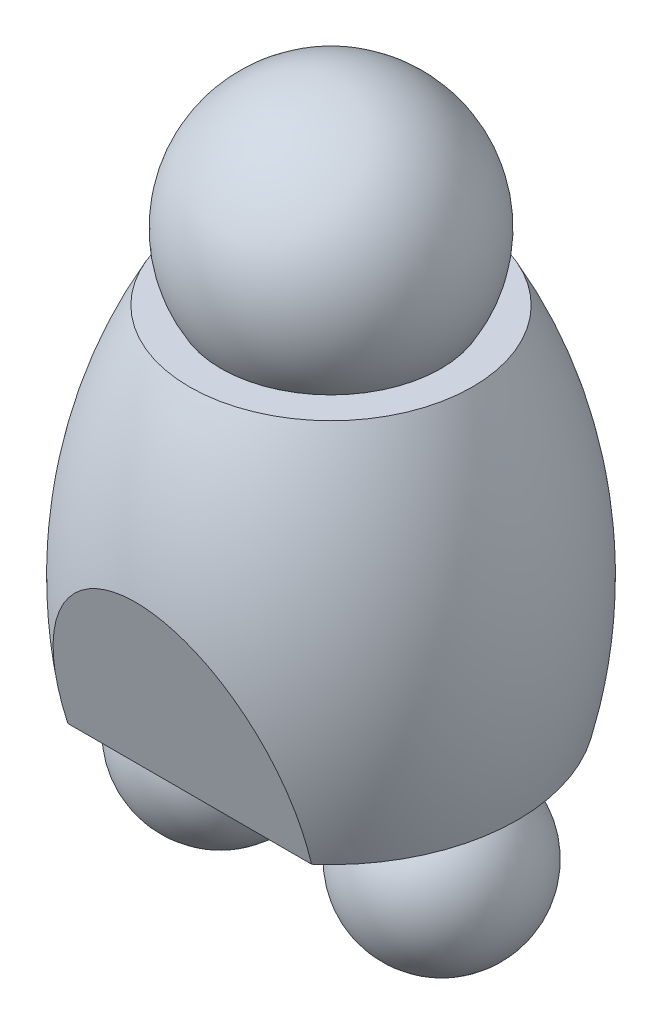
ISO-10303-21;
HEADER;
FILE_DESCRIPTION(('STEP AP214'),'2;1');
FILE_NAME('part.step','',(''),(''),'','','');
FILE_SCHEMA(('AUTOMOTIVE_DESIGN { 1 0 10303 214 1 1 1 1 }'));
ENDSEC;
DATA;
#1=APPLICATION_CONTEXT('core data for automotive mechanical design processes');
#2=APPLICATION_PROTOCOL_DEFINITION('international standard','automotive_design',2000,#1);
#3=PRODUCT_CONTEXT('',#1,'mechanical');
#4=PRODUCT('Part','Part','',(#3));
#5=PRODUCT_RELATED_PRODUCT_CATEGORY('part','',(#4));
#6=PRODUCT_DEFINITION_FORMATION('','',#4);
#7=PRODUCT_DEFINITION_CONTEXT('part definition',#1,'design');
#8=PRODUCT_DEFINITION('design','',#6,#7);
#9=PRODUCT_DEFINITION_SHAPE('','',#8);
#10=(LENGTH_UNIT() NAMED_UNIT(*) SI_UNIT(.MILLI.,.METRE.));
#11=(NAMED_UNIT(*) PLANE_ANGLE_UNIT() SI_UNIT($,.RADIAN.));
#12=(NAMED_UNIT(*) SI_UNIT($,.STERADIAN.) SOLID_ANGLE_UNIT());
#13=UNCERTAINTY_MEASURE_WITH_UNIT(LENGTH_MEASURE(1.E-05),#10,'distance_accuracy_value','');
#14=(GEOMETRIC_REPRESENTATION_CONTEXT(3) GLOBAL_UNCERTAINTY_ASSIGNED_CONTEXT((#13)) GLOBAL_UNIT_ASSIGNED_CONTEXT((#10,
#11,#12)) REPRESENTATION_CONTEXT('',''));
#15=CARTESIAN_POINT('',(0.,0.,0.));
#16=DIRECTION('',(0.,0.,1.));
#17=DIRECTION('',(1.,0.,0.));
#18=AXIS2_PLACEMENT_3D('',#15,#16,#17);
#19=CARTESIAN_POINT('',(-0.000631960450169172,92.8934839831583,0.520344473227464));
#20=DIRECTION('',(0.,-1.,0.));
#21=DIRECTION('',(0.,0.,-1.));
#22=AXIS2_PLACEMENT_3D('',#19,#20,#21);
#23=PLANE('',#22);
#24=CARTESIAN_POINT('',(-0.000631960450165436,92.8934839831583,0.520344473227464));
#25=DIRECTION('',(0.,-1.,0.));
#26=DIRECTION('',(0.,0.,-1.));
#27=AXIS2_PLACEMENT_3D('',#24,#25,#26);
#28=CIRCLE('',#27,60.2059088475542);
#29=CARTESIAN_POINT('',(-0.000631960450165436,92.8934839831583,-59.6855643743267));
#30=VERTEX_POINT('',#29);
#31=EDGE_CURVE('E72',#30,#30,#28,.T.);
#32=ORIENTED_EDGE('',*,*,#31,.T.);
#33=EDGE_LOOP('',(#32));
#34=FACE_BOUND('',#33,.T.);
#35=CARTESIAN_POINT('',(-0.000631960450165436,92.8934839831583,0.520344473227464));
#36=DIRECTION('',(0.,1.,0.));
#37=DIRECTION('',(0.,0.,1.));
#38=AXIS2_PLACEMENT_3D('',#35,#36,#37);
#39=CIRCLE('',#38,77.5335000000001);
#40=CARTESIAN_POINT('',(-0.000631960450165436,92.8934839831583,78.0538444732275));
#41=VERTEX_POINT('',#40);
#42=EDGE_CURVE('E78',#41,#41,#39,.T.);
#43=ORIENTED_EDGE('',*,*,#42,.T.);
#44=EDGE_LOOP('',(#43));
#45=FACE_BOUND('',#44,.T.);
#46=ADVANCED_FACE('F36',(#34,#45),#23,.F.);
#47=CARTESIAN_POINT('',(-0.000631960450110045,-100.235416016842,0.520344473227464));
#48=DIRECTION('',(0.,1.,0.));
#49=DIRECTION('',(0.,0.,1.));
#50=AXIS2_PLACEMENT_3D('',#47,#48,#49);
#51=PLANE('',#50);
#52=CARTESIAN_POINT('',(-60.6177319604502,-100.235416016842,0.520344473227464));
#53=DIRECTION('',(0.,1.,0.));
#54=DIRECTION('',(0.,0.,1.));
#55=AXIS2_PLACEMENT_3D('',#52,#53,#54);
#56=CIRCLE('',#55,23.5365025041615);
#57=CARTESIAN_POINT('',(-60.6177319604502,-100.235416016842,24.056846977389));
#58=VERTEX_POINT('',#57);
#59=EDGE_CURVE('E39',#58,#58,#56,.T.);
#60=ORIENTED_EDGE('',*,*,#59,.T.);
#61=EDGE_LOOP('',(#60));
#62=FACE_BOUND('',#61,.T.);
#63=CARTESIAN_POINT('',(60.6164680395499,-100.235416016842,0.520344473227464));
#64=DIRECTION('',(0.,1.,0.));
#65=DIRECTION('',(0.,0.,1.));
#66=AXIS2_PLACEMENT_3D('',#63,#64,#65);
#67=CIRCLE('',#66,23.5365025041615);
#68=CARTESIAN_POINT('',(60.6164680395499,-100.235416016842,24.056846977389));
#69=VERTEX_POINT('',#68);
#70=EDGE_CURVE('E168',#69,#69,#67,.T.);
#71=ORIENTED_EDGE('',*,*,#70,.T.);
#72=EDGE_LOOP('',(#71));
#73=FACE_BOUND('',#72,.T.);
#74=CARTESIAN_POINT('',(-0.000631960450165436,-100.235416016842,0.520344473227464));
#75=DIRECTION('',(0.,1.,0.));
#76=DIRECTION('',(0.,0.,1.));
#77=AXIS2_PLACEMENT_3D('',#74,#75,#76);
#78=CIRCLE('',#77,102.20325);
#79=CARTESIAN_POINT('',(66.7557596568943,-100.235416016842,77.9095458439242));
#80=VERTEX_POINT('',#79);
#81=CARTESIAN_POINT('',(65.7744504443835,-100.235416016842,-77.7046057996829));
#82=VERTEX_POINT('',#81);
#83=EDGE_CURVE('E71',#80,#82,#78,.T.);
#84=ORIENTED_EDGE('',*,*,#83,.F.);
#85=DIRECTION('',(1.,0.,0.));
#86=VECTOR('',#85,1.);
#87=CARTESIAN_POINT('',(-88.6722531373391,-100.235416016842,77.9095458439242));
#88=LINE('',#87,#86);
#89=CARTESIAN_POINT('',(-66.7570235777948,-100.235416016842,77.9095458439242));
#90=VERTEX_POINT('',#89);
#91=EDGE_CURVE('E51',#90,#80,#88,.T.);
#92=ORIENTED_EDGE('',*,*,#91,.F.);
#93=CARTESIAN_POINT('',(-65.775714365288,-100.235416016842,-77.7046057996829));
#94=VERTEX_POINT('',#93);
#95=EDGE_CURVE('E70',#94,#90,#78,.T.);
#96=ORIENTED_EDGE('',*,*,#95,.F.);
#97=DIRECTION('',(1.,0.,0.));
#98=VECTOR('',#97,1.);
#99=CARTESIAN_POINT('',(-88.6722531373391,-100.235416016842,-77.7046057996829));
#100=LINE('',#99,#98);
#101=EDGE_CURVE('E57',#94,#82,#100,.T.);
#102=ORIENTED_EDGE('',*,*,#101,.T.);
#103=EDGE_LOOP('',(#84,#92,#96,#102));
#104=FACE_BOUND('',#103,.T.);
#105=ADVANCED_FACE('F69',(#62,#73,#104),#51,.F.);
#106=CARTESIAN_POINT('',(-0.000631960450165436,-35.3522403414695,0.520344473227464));
#107=DIRECTION('',(0.,1.,0.));
#108=DIRECTION('',(0.,0.,1.));
#109=AXIS2_PLACEMENT_3D('',#106,#107,#108);
#110=DEGENERATE_TOROIDAL_SURFACE('',#109,158.150743998514,268.31703016525,.F.);
#111=ORIENTED_EDGE('',*,*,#95,.T.);
#112=CARTESIAN_POINT('',(-66.7569609332104,-100.236526016842,77.9092345565934));
#113=CARTESIAN_POINT('',(-66.872788325768,-98.1837089918451,78.4849245857282));
#114=CARTESIAN_POINT('',(-66.9474573206309,-96.1286980006077,79.0612298886423));
#115=CARTESIAN_POINT('',(-67.0126843765181,-92.0172661302769,80.2142358820627));
#116=CARTESIAN_POINT('',(-67.0032349179351,-89.9608451415701,80.790936603309));
#117=CARTESIAN_POINT('',(-66.8983056274531,-85.8458629247098,81.9449382524903));
#118=CARTESIAN_POINT('',(-66.8026552100979,-83.787305540609,82.522238102403));
#119=CARTESIAN_POINT('',(-66.5230686732191,-79.6759823977373,83.6752136043995));
#120=CARTESIAN_POINT('',(-66.3391331659362,-77.6232165989022,84.250889267719));
#121=CARTESIAN_POINT('',(-65.6463950833287,-71.4334002331213,85.9867554070606));
#122=CARTESIAN_POINT('',(-64.9976747229909,-67.3094089991089,87.1432835363342));
#123=CARTESIAN_POINT('',(-63.7314873336245,-61.1832583051651,88.8612953359912));
#124=CARTESIAN_POINT('',(-63.2608056350526,-59.1519330152644,89.4309582436374));
#125=CARTESIAN_POINT('',(-62.2183356449678,-55.112869738423,90.563669258408));
#126=CARTESIAN_POINT('',(-61.6465290795186,-53.1051360846969,91.1267161503299));
#127=CARTESIAN_POINT('',(-60.2348620292609,-48.5977292042425,92.3907689941705));
#128=CARTESIAN_POINT('',(-59.3640214364353,-46.1069676685449,93.0892757600406));
#129=CARTESIAN_POINT('',(-57.4483131055443,-41.1887807429596,94.468527364058));
#130=CARTESIAN_POINT('',(-56.4034932031941,-38.7613381551052,95.1492770251864));
#131=CARTESIAN_POINT('',(-54.1342841533093,-33.9938852065642,96.4862569378745));
#132=CARTESIAN_POINT('',(-52.9104365195986,-31.6536369865693,97.1425538944694));
#133=CARTESIAN_POINT('',(-50.2716378224709,-27.0752489665372,98.4265126207213));
#134=CARTESIAN_POINT('',(-48.8567439668709,-24.8370788671009,99.0541828875126));
#135=CARTESIAN_POINT('',(-46.2270918101071,-21.0652325708986,100.111955829627));
#136=CARTESIAN_POINT('',(-45.0583380277612,-19.5017604984104,100.550414431637));
#137=CARTESIAN_POINT('',(-42.6084503601267,-16.4582443016716,101.403935182214));
#138=CARTESIAN_POINT('',(-41.3273182650046,-14.9781988490665,101.818997703304));
#139=CARTESIAN_POINT('',(-38.6511934809151,-12.11921448754,102.620768523762));
#140=CARTESIAN_POINT('',(-37.2563191929189,-10.7401732065261,103.007505532262));
#141=CARTESIAN_POINT('',(-34.3496553645013,-8.1003234346088,103.74782245949));
#142=CARTESIAN_POINT('',(-32.8378575728233,-6.83952330186473,104.101400034264));
#143=CARTESIAN_POINT('',(-30.0858849496502,-4.75244126257096,104.686699311003));
#144=CARTESIAN_POINT('',(-28.8706121772676,-3.89565843546017,104.926974661751));
#145=CARTESIAN_POINT('',(-26.37689506619,-2.27309866843167,105.382003759902));
#146=CARTESIAN_POINT('',(-25.0984870087504,-1.5072703028082,105.596771929081));
#147=CARTESIAN_POINT('',(-22.481700388922,-0.0775974713915462,105.997708000805));
#148=CARTESIAN_POINT('',(-21.1433344685627,0.586268363546761,106.183881896094));
#149=CARTESIAN_POINT('',(-18.4119630773267,1.80063639957591,106.52443809839));
#150=CARTESIAN_POINT('',(-17.0189569180506,2.35113717186055,106.678820004705));
#151=CARTESIAN_POINT('',(-14.1725172260112,3.33237980677035,106.953998744067));
#152=CARTESIAN_POINT('',(-12.7186255832836,3.76189632014987,107.074451941352));
#153=CARTESIAN_POINT('',(-9.774383193654,4.48384256742148,107.276913851529));
#154=CARTESIAN_POINT('',(-8.28403247581015,4.77627241056886,107.358922595061));
#155=CARTESIAN_POINT('',(-5.28154482398903,5.21631063279682,107.482326490241));
#156=CARTESIAN_POINT('',(-3.76942608615992,5.36403356663187,107.523753767513));
#157=CARTESIAN_POINT('',(-0.737510484622833,5.51096841007953,107.564960033476));
#158=CARTESIAN_POINT('',(0.782285266054119,5.51020126327368,107.564744895564));
#159=CARTESIAN_POINT('',(3.59350612587824,5.37120400114509,107.525764637261));
#160=CARTESIAN_POINT('',(4.88604581571351,5.25295157137215,107.492602039761));
#161=CARTESIAN_POINT('',(7.45574117730913,4.91050205584891,107.396565827488));
#162=CARTESIAN_POINT('',(8.73289864250227,4.68631744591891,107.333695711423));
#163=CARTESIAN_POINT('',(11.2634428089755,4.13624885113426,107.17943500455));
#164=CARTESIAN_POINT('',(12.5168261369078,3.81035054679773,107.088040398));
#165=CARTESIAN_POINT('',(14.9923027061607,3.06264162142643,106.878353627192));
#166=CARTESIAN_POINT('',(16.2143941565605,2.64082552434127,106.760059927235));
#167=CARTESIAN_POINT('',(18.6357642916186,1.7024357639139,106.496898806716));
#168=CARTESIAN_POINT('',(19.8345879432756,1.1847771757119,106.35172713087));
#169=CARTESIAN_POINT('',(22.1891514692557,0.0657796319958744,106.037916537573));
#170=CARTESIAN_POINT('',(23.3448924556663,-0.535557161644107,105.869278226396));
#171=CARTESIAN_POINT('',(25.6102162584608,-1.81437188903122,105.510648656053));
#172=CARTESIAN_POINT('',(26.7197880948212,-2.49186779485608,105.320652356815));
#173=CARTESIAN_POINT('',(28.8905713163518,-3.91557862061731,104.921388264213));
#174=CARTESIAN_POINT('',(29.9517717470289,-4.66180899214454,104.712116137621));
#175=CARTESIAN_POINT('',(31.8040584586336,-6.0506339957805,104.322635391373));
#176=CARTESIAN_POINT('',(32.6046316344347,-6.6815630750296,104.145698248124));
#177=CARTESIAN_POINT('',(34.1744586137674,-7.97823150081166,103.782061803801));
#178=CARTESIAN_POINT('',(34.9437173242943,-8.64396535577759,103.595364042775));
#179=CARTESIAN_POINT('',(37.2053250392845,-10.6896538811438,103.02167312321));
#180=CARTESIAN_POINT('',(38.6510780874237,-12.1177718580049,102.6211730934));
#181=CARTESIAN_POINT('',(41.4214241484425,-15.0828540176047,101.789648308647));
#182=CARTESIAN_POINT('',(42.7457907034621,-16.6200125188505,101.35856905921));
#183=CARTESIAN_POINT('',(45.2740964320893,-19.7833637348597,100.471441891258));
#184=CARTESIAN_POINT('',(46.4780367593037,-21.4095555965091,100.01539421199));
#185=CARTESIAN_POINT('',(48.4497322414159,-24.2718854246767,99.2126851920891));
#186=CARTESIAN_POINT('',(49.2454884679306,-25.4903108667037,98.8709911347631));
#187=CARTESIAN_POINT('',(50.7781829692959,-27.9611432108878,98.1780732921643));
#188=CARTESIAN_POINT('',(51.5151159463443,-29.2135531602136,97.8268486523466));
#189=CARTESIAN_POINT('',(52.9319104388725,-31.7484750337586,97.1159576038674));
#190=CARTESIAN_POINT('',(53.6117515594122,-33.0309975074934,96.75628823671));
#191=CARTESIAN_POINT('',(54.9155974679279,-35.6219418820979,96.0296862919969));
#192=CARTESIAN_POINT('',(55.5396035066031,-36.9303632020344,95.6627538773575));
#193=CARTESIAN_POINT('',(57.3339607384958,-40.8979365548564,94.550091428017));
#194=CARTESIAN_POINT('',(58.4224336948415,-43.5917815230454,93.7946321399569));
#195=CARTESIAN_POINT('',(60.3920211079227,-49.0479010098315,92.2645232466345));
#196=CARTESIAN_POINT('',(61.2731542786786,-51.810169327799,91.4898753802707));
#197=CARTESIAN_POINT('',(62.5786129741929,-56.4608606544736,90.1856399843494));
#198=CARTESIAN_POINT('',(63.0575219693184,-58.3352720875855,89.6599818475553));
#199=CARTESIAN_POINT('',(63.929905236594,-62.1024333769716,88.6035227642399));
#200=CARTESIAN_POINT('',(64.3233738689206,-63.9951844352149,88.0727214806394));
#201=CARTESIAN_POINT('',(65.3796078822151,-69.6969298691087,86.4737294833068));
#202=CARTESIAN_POINT('',(65.9178444002289,-73.5281271869769,85.3993121978459));
#203=CARTESIAN_POINT('',(66.4860529502503,-79.2727523817356,83.7882950416798));
#204=CARTESIAN_POINT('',(66.6354118135882,-81.1763455975697,83.2544531938482));
#205=CARTESIAN_POINT('',(66.8587322346051,-84.9878359006366,82.1855625246355));
#206=CARTESIAN_POINT('',(66.9326920226326,-86.8957330878324,81.650513675221));
#207=CARTESIAN_POINT('',(67.0067357521847,-90.710136680936,80.5808060057567));
#208=CARTESIAN_POINT('',(67.0069220539981,-92.616641343556,80.0461476745928));
#209=CARTESIAN_POINT('',(66.9350957716905,-96.4282325542835,78.9772287069331));
#210=CARTESIAN_POINT('',(66.8630894281279,-98.3333192107229,78.4429680400566));
#211=CARTESIAN_POINT('',(66.75569701231,-100.236526016842,77.9092345565934));
#212=B_SPLINE_CURVE_WITH_KNOTS('',3,(#112,#113,#114,#115,#116,#117,#118,#119,#120,#121,#122,
#123,#124,#125,#126,#127,#128,#129,#130,#131,#132,#133,#134,#135,#136,#137,#138,#139,#140,#141,
#142,#143,#144,#145,#146,#147,#148,#149,#150,#151,#152,#153,#154,#155,#156,#157,#158,#159,#160,
#161,#162,#163,#164,#165,#166,#167,#168,#169,#170,#171,#172,#173,#174,#175,#176,#177,#178,#179,
#180,#181,#182,#183,#184,#185,#186,#187,#188,#189,#190,#191,#192,#193,#194,#195,#196,#197,#198,
#199,#200,#201,#202,#203,#204,#205,#206,#207,#208,#209,#210,#211),.UNSPECIFIED.,.F.,.F.,(4,2,2,
2,2,2,2,2,2,2,2,2,2,2,2,2,2,2,2,2,2,2,2,2,2,2,2,2,2,2,2,2,2,2,2,2,2,2,2,2,2,2,2,2,2,2,2,2,2,4),
(0.,6.40511797044445,12.8108085198389,19.229203369971,25.6475537103652,38.6227740426619,
45.1055129440022,51.5894245186428,59.7719008404448,67.9521310891058,76.1081111047652,
84.2616542477147,90.2592686995152,96.2567876277301,102.248141188815,108.239917944394,
112.754761152236,117.267039388526,121.778370654497,126.289758775935,130.845318476679,
135.400874546729,139.952821367155,144.504126164898,148.394519072494,152.284453915787,
156.17493664004,160.065641531945,164.003429309568,167.941115371086,171.879732608783,
175.819237423434,178.921760184026,182.023794891137,188.229489941421,194.446536177868,
200.663522853254,205.146533263484,209.629946972877,214.114955540149,218.599863618606,
227.596493642973,236.592311340121,242.604706253393,248.617497917617,260.64722566274,
266.594202215557,272.541318343476,278.480182852942,284.418534032617),.UNSPECIFIED.);
#213=EDGE_CURVE('E11',#90,#80,#212,.T.);
#214=ORIENTED_EDGE('',*,*,#213,.T.);
#215=ORIENTED_EDGE('',*,*,#83,.T.);
#216=CARTESIAN_POINT('',(65.7745593709998,-100.236526016842,-77.7041527866835));
#217=CARTESIAN_POINT('',(65.6178854596672,-98.6401375414282,-78.3556705628246));
#218=CARTESIAN_POINT('',(65.4306426493434,-97.0462698817012,-79.0061595441232));
#219=CARTESIAN_POINT('',(64.9933099148206,-93.8657685688657,-80.3041851652464));
#220=CARTESIAN_POINT('',(64.7432127899856,-92.2791357658056,-80.9517214581494));
#221=CARTESIAN_POINT('',(64.1779023503898,-89.1123309972418,-82.2441572480992));
#222=CARTESIAN_POINT('',(63.8625529522297,-87.5321796872422,-82.8890483152254));
#223=CARTESIAN_POINT('',(63.1653009394367,-84.3846904180807,-84.1736010670492));
#224=CARTESIAN_POINT('',(62.7833992271659,-82.8173522854904,-84.8132628225263));
#225=CARTESIAN_POINT('',(61.5252768999824,-78.1027046166344,-86.7374039772703));
#226=CARTESIAN_POINT('',(60.5429011052585,-74.9785660170028,-88.0124268580646));
#227=CARTESIAN_POINT('',(58.8470163610535,-70.3652387353385,-89.895217154695));
#228=CARTESIAN_POINT('',(58.2449451587119,-68.8401885038375,-90.5176203796204));
#229=CARTESIAN_POINT('',(56.9639723444844,-65.817510134064,-91.7512353297375));
#230=CARTESIAN_POINT('',(56.2850562569764,-64.3198872243377,-92.3624449210559));
#231=CARTESIAN_POINT('',(54.6362530988615,-60.9208099211684,-93.7496757358606));
#232=CARTESIAN_POINT('',(53.639578477915,-59.030407836997,-94.5211862928839));
#233=CARTESIAN_POINT('',(51.508364376149,-55.3178617308811,-96.0363499389078));
#234=CARTESIAN_POINT('',(50.3738629749091,-53.4956990365598,-96.7800106484754));
#235=CARTESIAN_POINT('',(47.9652083139593,-49.939951573665,-98.2311816605592));
#236=CARTESIAN_POINT('',(46.6915065247663,-48.2061057021967,-98.9387985243416));
#237=CARTESIAN_POINT('',(43.9969266340659,-44.8393258713536,-100.312848100576));
#238=CARTESIAN_POINT('',(42.5760851103969,-43.2063669926151,-100.979290983115));
#239=CARTESIAN_POINT('',(39.9146220295896,-40.4106035566563,-102.120297451444));
#240=CARTESIAN_POINT('',(38.7035617299262,-39.2236471763175,-102.604717874921));
#241=CARTESIAN_POINT('',(36.1893577128054,-36.9361470461021,-103.538292014746));
#242=CARTESIAN_POINT('',(34.8862173972507,-35.8356001069906,-103.987447032683));
#243=CARTESIAN_POINT('',(32.1895222212183,-33.7352056497603,-104.844659639057));
#244=CARTESIAN_POINT('',(30.7960222644915,-32.7352979073458,-105.252741806222));
#245=CARTESIAN_POINT('',(27.9208921712897,-30.8505815616183,-106.021931900699));
#246=CARTESIAN_POINT('',(26.4392805351173,-29.965748920116,-106.383049638472));
#247=CARTESIAN_POINT('',(23.6881672323769,-28.4855842882818,-106.987134160572));
#248=CARTESIAN_POINT('',(22.4330134919931,-27.8673518247539,-107.239447081881));
#249=CARTESIAN_POINT('',(19.8737688347811,-26.7247201171464,-107.705777727932));
#250=CARTESIAN_POINT('',(18.5696833755584,-26.2003104459419,-107.919799708191));
#251=CARTESIAN_POINT('',(15.919565656457,-25.253805238148,-108.306087242576));
#252=CARTESIAN_POINT('',(14.5735564891887,-24.8316544615369,-108.47837534125));
#253=CARTESIAN_POINT('',(11.8469934811457,-24.0967145793228,-108.778318873186));
#254=CARTESIAN_POINT('',(10.466439240616,-23.783926739894,-108.905973789697));
#255=CARTESIAN_POINT('',(7.67323356444715,-23.2724020502396,-109.114737153614));
#256=CARTESIAN_POINT('',(6.26045139359021,-23.0742744342941,-109.195596960435));
#257=CARTESIAN_POINT('',(3.42115941680233,-22.7987466961405,-109.308045291146));
#258=CARTESIAN_POINT('',(1.99464960094524,-22.7213466612343,-109.339633779407));
#259=CARTESIAN_POINT('',(-0.859807377291251,-22.6889359561831,-109.352861230496));
#260=CARTESIAN_POINT('',(-2.28775433281376,-22.733909655106,-109.334506572618));
#261=CARTESIAN_POINT('',(-5.13305695317281,-22.9452512950161,-109.248253860724));
#262=CARTESIAN_POINT('',(-6.55041306336485,-23.1116141021186,-109.180357901949));
#263=CARTESIAN_POINT('',(-9.24792983184872,-23.5437701816613,-109.00398644085));
#264=CARTESIAN_POINT('',(-10.5298347259603,-23.8003242548863,-108.899281638841));
#265=CARTESIAN_POINT('',(-13.066887112754,-24.4084673651668,-108.651086382556));
#266=CARTESIAN_POINT('',(-14.3220369492669,-24.7600480403607,-108.507599340922));
#267=CARTESIAN_POINT('',(-16.7991321938811,-25.5529110198541,-108.18401624499));
#268=CARTESIAN_POINT('',(-18.0210682048083,-25.9942184170851,-108.00390994977));
#269=CARTESIAN_POINT('',(-20.4258643273034,-26.9602527306675,-107.60965220026));
#270=CARTESIAN_POINT('',(-21.6087186313985,-27.4849919781074,-107.395495713407));
#271=CARTESIAN_POINT('',(-24.3042214937704,-28.7923530651633,-106.861935742779));
#272=CARTESIAN_POINT('',(-25.8007046646039,-29.603658519093,-106.530825907513));
#273=CARTESIAN_POINT('',(-28.7107615026857,-31.3449742764291,-105.82016043526));
#274=CARTESIAN_POINT('',(-30.1243135933022,-32.2750152737631,-105.440592271473));
#275=CARTESIAN_POINT('',(-32.865637852594,-34.2397780064773,-104.638733660002));
#276=CARTESIAN_POINT('',(-34.1933296965331,-35.2745955065045,-104.216404128868));
#277=CARTESIAN_POINT('',(-36.7597728403246,-37.4344540334314,-103.334923057114));
#278=CARTESIAN_POINT('',(-37.9985196401927,-38.5594996191407,-102.875769655954));
#279=CARTESIAN_POINT('',(-40.8236625967287,-41.3131652805868,-101.751944123753));
#280=CARTESIAN_POINT('',(-42.3717152125132,-42.9755896325411,-101.07347579761));
#281=CARTESIAN_POINT('',(-45.3051578676127,-46.4192380416621,-99.6680546310975));
#282=CARTESIAN_POINT('',(-46.6904887958899,-48.2005049039344,-98.9410843211164));
#283=CARTESIAN_POINT('',(-49.30855793568,-51.8667676306657,-97.4448098395242));
#284=CARTESIAN_POINT('',(-50.5406491816629,-53.7521577794822,-96.6753447526523));
#285=CARTESIAN_POINT('',(-52.8520342125732,-57.6020764457258,-95.1041166422104));
#286=CARTESIAN_POINT('',(-53.9312781577829,-59.566630509545,-94.3023431926514));
#287=CARTESIAN_POINT('',(-55.7064190000442,-63.0898570368098,-92.8644446189409));
#288=CARTESIAN_POINT('',(-56.4328132170315,-64.6354693639721,-92.2336495952495));
#289=CARTESIAN_POINT('',(-57.802151796282,-67.7574843188531,-90.959493415967));
#290=CARTESIAN_POINT('',(-58.4451146422725,-69.333880037352,-90.3161350801655));
#291=CARTESIAN_POINT('',(-60.2545405584571,-74.1058871268845,-88.3685844090191));
#292=CARTESIAN_POINT('',(-61.3001916354214,-77.3416033633125,-87.0480244832559));
#293=CARTESIAN_POINT('',(-62.6344047480085,-82.2230195476885,-85.0558217920906));
#294=CARTESIAN_POINT('',(-63.0380134931638,-83.8430427771675,-84.3946582043907));
#295=CARTESIAN_POINT('',(-63.7737713649072,-87.0971354764228,-83.0665984799388));
#296=CARTESIAN_POINT('',(-64.1059195334029,-88.7312051342182,-82.3997022664524));
#297=CARTESIAN_POINT('',(-64.7000024437642,-92.0061475684548,-81.0631333519271));
#298=CARTESIAN_POINT('',(-64.9621028733956,-93.6469947993818,-80.3934710765189));
#299=CARTESIAN_POINT('',(-65.418973324028,-96.9365064422006,-79.0509561792195));
#300=CARTESIAN_POINT('',(-65.6137518780681,-98.5851698365217,-78.3781039726191));
#301=CARTESIAN_POINT('',(-65.7758232919002,-100.236526016842,-77.7041527866835));
#302=B_SPLINE_CURVE_WITH_KNOTS('',3,(#216,#217,#218,#219,#220,#221,#222,#223,#224,#225,#226,
#227,#228,#229,#230,#231,#232,#233,#234,#235,#236,#237,#238,#239,#240,#241,#242,#243,#244,#245,
#246,#247,#248,#249,#250,#251,#252,#253,#254,#255,#256,#257,#258,#259,#260,#261,#262,#263,#264,
#265,#266,#267,#268,#269,#270,#271,#272,#273,#274,#275,#276,#277,#278,#279,#280,#281,#282,#283,
#284,#285,#286,#287,#288,#289,#290,#291,#292,#293,#294,#295,#296,#297,#298,#299,#300,#301),
.UNSPECIFIED.,.F.,.F.,(4,2,2,2,2,2,2,2,2,2,2,2,2,2,2,2,2,2,2,2,2,2,2,2,2,2,2,2,2,2,2,2,2,2,2,2,
2,2,2,2,2,2,4),(0.,5.19376470411466,10.3881246811386,15.5934286784431,20.798662104137,
31.3263424152006,36.5860944154881,41.8468388734414,48.6578781230778,55.4670398408171,
62.2547383169165,69.0407534541169,74.3271418524313,79.6133350467698,84.8963458418016,
90.1782512831019,94.4393324307539,98.6999397227412,102.958240285896,107.216590148859,
111.497363318321,115.778139583342,120.058369085759,124.338417575798,128.26860773906,
132.198452177943,136.129397150623,140.060923651412,145.255812838757,150.452047669062,
155.653075427324,160.854366135322,167.956028070359,175.060261861626,182.193538419743,
189.329135633515,194.788559803789,200.246772398338,211.172843377748,216.558896607186,
221.945022044482,227.318292305674,232.690881255578),.UNSPECIFIED.);
#303=EDGE_CURVE('E44',#82,#94,#302,.T.);
#304=ORIENTED_EDGE('',*,*,#303,.T.);
#305=EDGE_LOOP('',(#111,#214,#215,#304));
#306=FACE_BOUND('',#305,.T.);
#307=ORIENTED_EDGE('',*,*,#42,.F.);
#308=EDGE_LOOP('',(#307));
#309=FACE_BOUND('',#308,.T.);
#310=ADVANCED_FACE('F74',(#306,#309),#110,.F.);
#311=CARTESIAN_POINT('',(-88.6722531373391,-22.7019160168417,-109.347563810485));
#312=DIRECTION('',(0.,0.377862516558174,0.925861716770017));
#313=DIRECTION('',(0.,-0.925861716770017,0.377862516558174));
#314=AXIS2_PLACEMENT_3D('',#311,#312,#313);
#315=PLANE('',#314);
#316=ORIENTED_EDGE('',*,*,#101,.F.);
#317=ORIENTED_EDGE('',*,*,#303,.F.);
#318=EDGE_LOOP('',(#316,#317));
#319=FACE_BOUND('',#318,.T.);
#320=ADVANCED_FACE('F92',(#319),#315,.F.);
#321=CARTESIAN_POINT('',(-88.6722531373391,-100.235416016842,77.9095458439242));
#322=DIRECTION('',(0.,0.270021899081537,-0.962854181076449));
#323=DIRECTION('',(0.,0.962854181076449,0.270021899081537));
#324=AXIS2_PLACEMENT_3D('',#321,#322,#323);
#325=PLANE('',#324);
#326=ORIENTED_EDGE('',*,*,#91,.T.);
#327=ORIENTED_EDGE('',*,*,#213,.F.);
#328=EDGE_LOOP('',(#326,#327));
#329=FACE_BOUND('',#328,.T.);
#330=ADVANCED_FACE('F63',(#329),#325,.F.);
#331=CARTESIAN_POINT('',(-0.000631960450165436,129.545683983158,0.520344473227464));
#332=DIRECTION('',(0.,-1.,0.));
#333=DIRECTION('',(-1.,0.,0.));
#334=AXIS2_PLACEMENT_3D('',#331,#332,#333);
#335=SPHERICAL_SURFACE('',#334,70.485);
#336=ORIENTED_EDGE('',*,*,#31,.F.);
#337=EDGE_LOOP('',(#336));
#338=FACE_BOUND('',#337,.T.);
#339=ADVANCED_FACE('F98',(#338),#335,.T.);
#340=CARTESIAN_POINT('',(60.6164680395499,-139.707016016842,0.520344473227464));
#341=DIRECTION('',(0.,-1.,0.));
#342=DIRECTION('',(-1.,0.,0.));
#343=AXIS2_PLACEMENT_3D('',#340,#341,#342);
#344=SPHERICAL_SURFACE('',#343,45.95622);
#345=ORIENTED_EDGE('',*,*,#70,.F.);
#346=EDGE_LOOP('',(#345));
#347=FACE_BOUND('',#346,.T.);
#348=ADVANCED_FACE('F101',(#347),#344,.T.);
#349=CARTESIAN_POINT('',(-60.6177319604502,-139.707016016842,0.520344473227464));
#350=DIRECTION('',(0.,-1.,0.));
#351=DIRECTION('',(1.,0.,0.));
#352=AXIS2_PLACEMENT_3D('',#349,#350,#351);
#353=SPHERICAL_SURFACE('',#352,45.95622);
#354=ORIENTED_EDGE('',*,*,#59,.F.);
#355=EDGE_LOOP('',(#354));
#356=FACE_BOUND('',#355,.T.);
#357=ADVANCED_FACE('F105',(#356),#353,.T.);
#358=CLOSED_SHELL('',(#46,#105,#310,#320,#330,#339,#348,#357));
#359=MANIFOLD_SOLID_BREP('B2',#358);
#360=ADVANCED_BREP_SHAPE_REPRESENTATION('',(#18,#359),#14);
#361=SHAPE_DEFINITION_REPRESENTATION(#9,#360);
ENDSEC;
END-ISO-10303-21;
